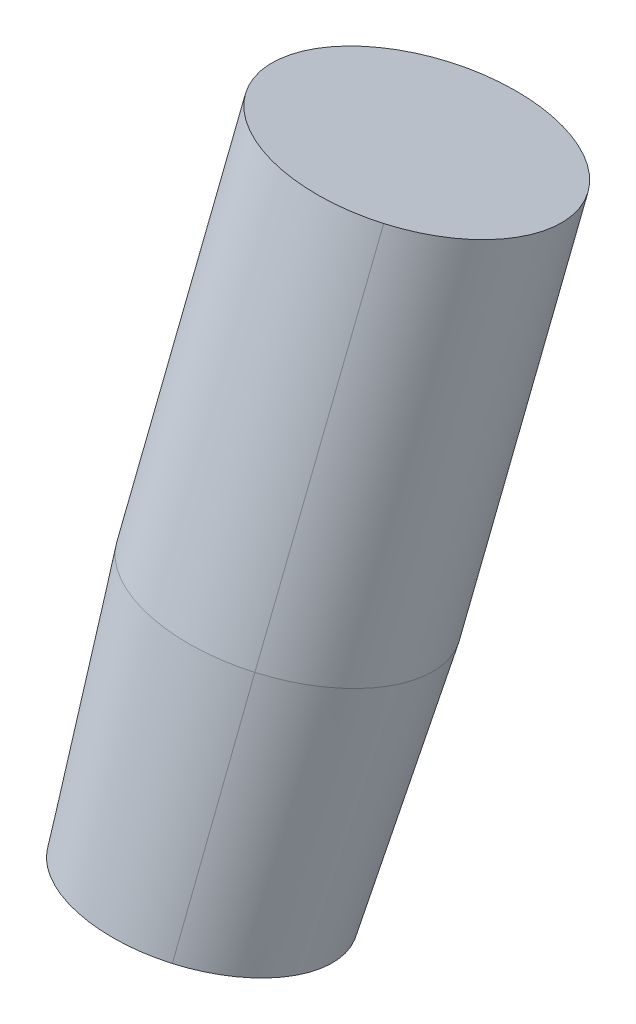
ISO-10303-21;
HEADER;
FILE_DESCRIPTION(('STEP AP214'),'2;1');
FILE_NAME('part.step','',(''),(''),'','','');
FILE_SCHEMA(('AUTOMOTIVE_DESIGN { 1 0 10303 214 1 1 1 1 }'));
ENDSEC;
DATA;
#1=APPLICATION_CONTEXT('core data for automotive mechanical design processes');
#2=APPLICATION_PROTOCOL_DEFINITION('international standard','automotive_design',2000,#1);
#3=PRODUCT_CONTEXT('',#1,'mechanical');
#4=PRODUCT('Part','Part','',(#3));
#5=PRODUCT_RELATED_PRODUCT_CATEGORY('part','',(#4));
#6=PRODUCT_DEFINITION_FORMATION('','',#4);
#7=PRODUCT_DEFINITION_CONTEXT('part definition',#1,'design');
#8=PRODUCT_DEFINITION('design','',#6,#7);
#9=PRODUCT_DEFINITION_SHAPE('','',#8);
#10=(LENGTH_UNIT() NAMED_UNIT(*) SI_UNIT(.MILLI.,.METRE.));
#11=(NAMED_UNIT(*) PLANE_ANGLE_UNIT() SI_UNIT($,.RADIAN.));
#12=(NAMED_UNIT(*) SI_UNIT($,.STERADIAN.) SOLID_ANGLE_UNIT());
#13=UNCERTAINTY_MEASURE_WITH_UNIT(LENGTH_MEASURE(1.E-05),#10,'distance_accuracy_value','');
#14=(GEOMETRIC_REPRESENTATION_CONTEXT(3) GLOBAL_UNCERTAINTY_ASSIGNED_CONTEXT((#13)) GLOBAL_UNIT_ASSIGNED_CONTEXT((#10,
#11,#12)) REPRESENTATION_CONTEXT('',''));
#15=CARTESIAN_POINT('',(0.,0.,0.));
#16=DIRECTION('',(0.,0.,1.));
#17=DIRECTION('',(1.,0.,0.));
#18=AXIS2_PLACEMENT_3D('',#15,#16,#17);
#19=CARTESIAN_POINT('',(-130.43795404574,-48.7087332265,-109.873795502829));
#20=DIRECTION('',(-0.108859783540952,-0.966658099120577,0.231779349666899));
#21=DIRECTION('',(0.,-0.233165022623977,-0.972437181634249));
#22=AXIS2_PLACEMENT_3D('',#19,#20,#21);
#23=PLANE('',#22);
#24=CARTESIAN_POINT('',(-119.69746805528,-40.70923617933,-71.4666397214994));
#25=DIRECTION('',(-0.108859783540952,-0.966658099120577,0.231779349666899));
#26=DIRECTION('',(-0.410942207855446,0.256070535994662,0.874959646154208));
#27=AXIS2_PLACEMENT_3D('',#24,#25,#26);
#28=CIRCLE('',#27,2.);
#29=CARTESIAN_POINT('',(-118.58291472143,-40.44176827966,-69.8276669368994));
#30=VERTEX_POINT('',#29);
#31=CARTESIAN_POINT('',(-120.81202138914,-40.97670407899,-73.1056125060994));
#32=VERTEX_POINT('',#31);
#33=EDGE_CURVE('E35',#30,#32,#28,.T.);
#34=ORIENTED_EDGE('',*,*,#33,.F.);
#35=CARTESIAN_POINT('',(-119.69746805528,-40.70923617933,-71.4666397214994));
#36=DIRECTION('',(-0.108859783540952,-0.966658099120577,0.231779349666899));
#37=DIRECTION('',(-0.410942207855446,0.256070535994662,0.874959646154208));
#38=AXIS2_PLACEMENT_3D('',#35,#36,#37);
#39=CIRCLE('',#38,2.);
#40=EDGE_CURVE('E27',#32,#30,#39,.T.);
#41=ORIENTED_EDGE('',*,*,#40,.F.);
#42=EDGE_LOOP('',(#34,#41));
#43=FACE_BOUND('',#42,.T.);
#44=ADVANCED_FACE('F17',(#43),#23,.F.);
#45=CARTESIAN_POINT('',(-120.24176697299,-45.5425266749,-70.3077429731994));
#46=DIRECTION('',(-0.108859783540952,-0.966658099120577,0.231779349666899));
#47=DIRECTION('',(0.,-0.233165022623976,-0.972437181634249));
#48=AXIS2_PLACEMENT_3D('',#45,#46,#47);
#49=CYLINDRICAL_SURFACE('',#48,2.);
#50=DIRECTION('',(0.108859783540952,0.966658099120577,-0.231779349666899));
#51=VECTOR('',#50,1.);
#52=CARTESIAN_POINT('',(-121.35632030684,-45.8099945746,-71.9467157576994));
#53=LINE('',#52,#51);
#54=CARTESIAN_POINT('',(-121.46518009038,-46.7766526737,-71.7149364080994));
#55=VERTEX_POINT('',#54);
#56=EDGE_CURVE('E11',#55,#32,#53,.T.);
#57=ORIENTED_EDGE('',*,*,#56,.T.);
#58=ORIENTED_EDGE('',*,*,#40,.T.);
#59=DIRECTION('',(0.108859783540952,0.966658099120577,-0.231779349666899));
#60=VECTOR('',#59,1.);
#61=CARTESIAN_POINT('',(-119.12721363913,-45.2750587753,-68.6687701885994));
#62=LINE('',#61,#60);
#63=CARTESIAN_POINT('',(-119.23607342267,-46.2417168744,-68.4369908388994));
#64=VERTEX_POINT('',#63);
#65=EDGE_CURVE('E71',#64,#30,#62,.T.);
#66=ORIENTED_EDGE('',*,*,#65,.F.);
#67=CARTESIAN_POINT('',(-120.35062675653,-46.5091847741,-70.0759636234994));
#68=DIRECTION('',(-0.108859783540952,-0.966658099120577,0.231779349666899));
#69=DIRECTION('',(-0.410942207855446,0.256070535994662,0.874959646154208));
#70=AXIS2_PLACEMENT_3D('',#67,#68,#69);
#71=CIRCLE('',#70,2.);
#72=EDGE_CURVE('E67',#55,#64,#71,.T.);
#73=ORIENTED_EDGE('',*,*,#72,.F.);
#74=EDGE_LOOP('',(#57,#58,#66,#73));
#75=FACE_BOUND('',#74,.T.);
#76=ADVANCED_FACE('F79',(#75),#49,.T.);
#77=CARTESIAN_POINT('',(-120.24176697299,-45.5425266749,-70.3077429731994));
#78=DIRECTION('',(-0.108859783540952,-0.966658099120577,0.231779349666899));
#79=DIRECTION('',(0.,-0.233165022623976,-0.972437181634249));
#80=AXIS2_PLACEMENT_3D('',#77,#78,#79);
#81=CYLINDRICAL_SURFACE('',#80,2.);
#82=ORIENTED_EDGE('',*,*,#65,.T.);
#83=ORIENTED_EDGE('',*,*,#33,.T.);
#84=ORIENTED_EDGE('',*,*,#56,.F.);
#85=CARTESIAN_POINT('',(-120.35062675653,-46.5091847741,-70.0759636234994));
#86=DIRECTION('',(-0.108859783540952,-0.966658099120577,0.231779349666899));
#87=DIRECTION('',(-0.410942207855446,0.256070535994662,0.874959646154208));
#88=AXIS2_PLACEMENT_3D('',#85,#86,#87);
#89=CIRCLE('',#88,2.);
#90=EDGE_CURVE('E58',#64,#55,#89,.T.);
#91=ORIENTED_EDGE('',*,*,#90,.F.);
#92=EDGE_LOOP('',(#82,#83,#84,#91));
#93=FACE_BOUND('',#92,.T.);
#94=ADVANCED_FACE('F76',(#93),#81,.T.);
#95=CARTESIAN_POINT('',(-131.52655188115,-58.3753142177,-107.556002006159));
#96=DIRECTION('',(-0.108859783540952,-0.966658099120577,0.231779349666899));
#97=DIRECTION('',(0.,-0.233165022623977,-0.972437181634249));
#98=AXIS2_PLACEMENT_3D('',#95,#96,#97);
#99=PLANE('',#98);
#100=CARTESIAN_POINT('',(-120.786065890685,-50.3758171705554,-69.1488462248086));
#101=DIRECTION('',(-0.108859783540952,-0.966658099120577,0.231779349666899));
#102=DIRECTION('',(0.,-0.233165022623976,-0.972437181634249));
#103=AXIS2_PLACEMENT_3D('',#100,#101,#102);
#104=CIRCLE('',#103,1.79999999999865);
#105=CARTESIAN_POINT('',(-119.782967662079,-50.1350961213539,-67.673770863946));
#106=VERTEX_POINT('',#105);
#107=CARTESIAN_POINT('',(-121.789163891145,-50.6165382802296,-70.6239217309444));
#108=VERTEX_POINT('',#107);
#109=EDGE_CURVE('E57',#106,#108,#104,.T.);
#110=ORIENTED_EDGE('',*,*,#109,.T.);
#111=CARTESIAN_POINT('',(-120.78606589069,-50.3758171705,-69.1488462247994));
#112=DIRECTION('',(-0.108859783540952,-0.966658099120577,0.231779349666899));
#113=DIRECTION('',(-0.410942207855449,0.256070535994662,0.874959646154207));
#114=AXIS2_PLACEMENT_3D('',#111,#112,#113);
#115=CIRCLE('',#114,1.8);
#116=EDGE_CURVE('E49',#108,#106,#115,.T.);
#117=ORIENTED_EDGE('',*,*,#116,.T.);
#118=EDGE_LOOP('',(#110,#117));
#119=FACE_BOUND('',#118,.T.);
#120=ADVANCED_FACE('F60',(#119),#99,.T.);
#121=CARTESIAN_POINT('',(-124.70501809816,-85.1755087389,-60.8047896367994));
#122=DIRECTION('',(0.108859783540952,0.966658099120577,-0.231779349666899));
#123=DIRECTION('',(-0.557276666926796,-0.133733949833095,-0.81948639229764));
#124=AXIS2_PLACEMENT_3D('',#121,#122,#123);
#125=CONICAL_SURFACE('',#124,0.,0.0499583957219001);
#126=DIRECTION('',(-0.136553032146009,-0.972130392151067,0.190566970034013));
#127=VECTOR('',#126,1.);
#128=CARTESIAN_POINT('',(-119.50952065645,-48.1884064676,-68.0553807787994));
#129=LINE('',#128,#127);
#130=EDGE_CURVE('E56',#64,#106,#129,.T.);
#131=ORIENTED_EDGE('',*,*,#130,.F.);
#132=ORIENTED_EDGE('',*,*,#90,.T.);
#133=DIRECTION('',(-0.0808948946962735,-0.958773682632686,0.272413365132911));
#134=VECTOR('',#133,1.);
#135=CARTESIAN_POINT('',(-121.62717199077,-48.696595477,-71.1694290694994));
#136=LINE('',#135,#134);
#137=EDGE_CURVE('E21',#55,#108,#136,.T.);
#138=ORIENTED_EDGE('',*,*,#137,.T.);
#139=ORIENTED_EDGE('',*,*,#109,.F.);
#140=EDGE_LOOP('',(#131,#132,#138,#139));
#141=FACE_BOUND('',#140,.T.);
#142=ADVANCED_FACE('F64',(#141),#125,.T.);
#143=CARTESIAN_POINT('',(-124.70501809815,-85.1755087389,-60.8047896367994));
#144=DIRECTION('',(0.108859783540952,0.966658099120577,-0.231779349666899));
#145=DIRECTION('',(-0.557276666926796,-0.133733949833095,-0.81948639229764));
#146=AXIS2_PLACEMENT_3D('',#143,#144,#145);
#147=CONICAL_SURFACE('',#146,0.,0.0499583957219001);
#148=ORIENTED_EDGE('',*,*,#137,.F.);
#149=ORIENTED_EDGE('',*,*,#72,.T.);
#150=ORIENTED_EDGE('',*,*,#130,.T.);
#151=ORIENTED_EDGE('',*,*,#116,.F.);
#152=EDGE_LOOP('',(#148,#149,#150,#151));
#153=FACE_BOUND('',#152,.T.);
#154=ADVANCED_FACE('F19',(#153),#147,.T.);
#155=CLOSED_SHELL('',(#44,#76,#94,#120,#142,#154));
#156=MANIFOLD_SOLID_BREP('B1',#155);
#157=ADVANCED_BREP_SHAPE_REPRESENTATION('',(#18,#156),#14);
#158=SHAPE_DEFINITION_REPRESENTATION(#9,#157);
ENDSEC;
END-ISO-10303-21;
